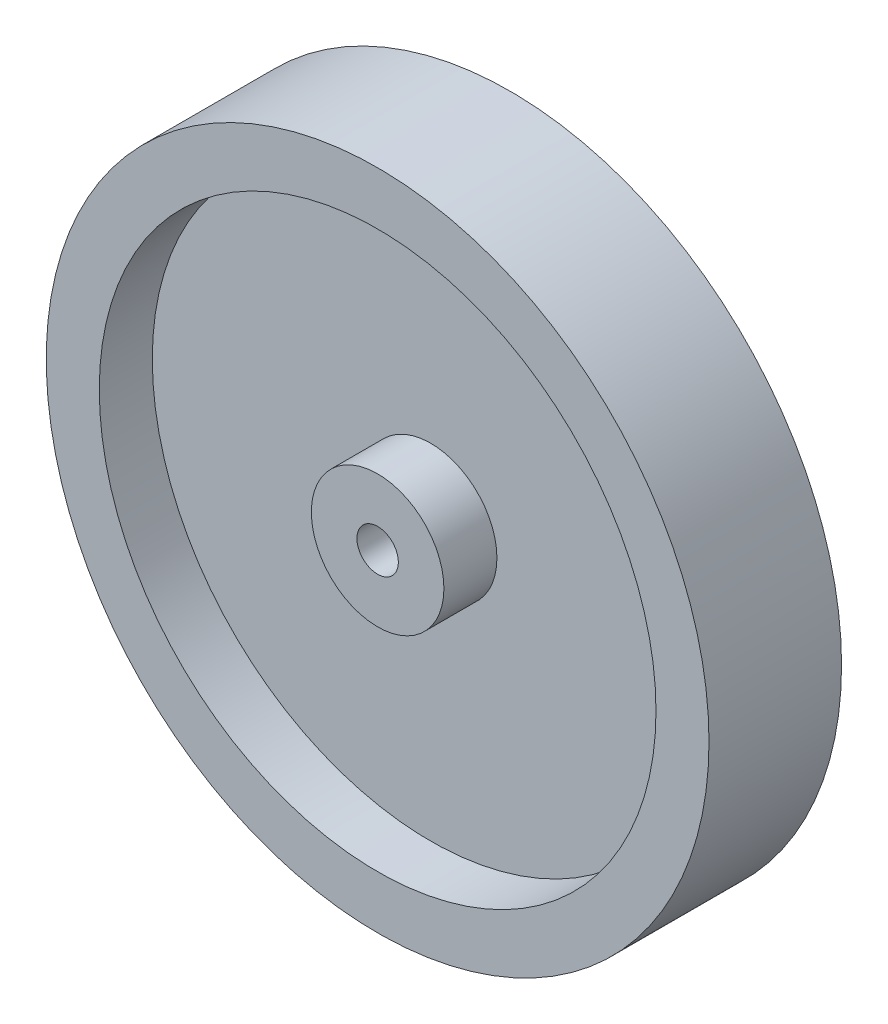
ISO-10303-21;
HEADER;
FILE_DESCRIPTION(('STEP AP214'),'2;1');
FILE_NAME('part.step','',(''),(''),'','','');
FILE_SCHEMA(('AUTOMOTIVE_DESIGN { 1 0 10303 214 1 1 1 1 }'));
ENDSEC;
DATA;
#1=APPLICATION_CONTEXT('core data for automotive mechanical design processes');
#2=APPLICATION_PROTOCOL_DEFINITION('international standard','automotive_design',2000,#1);
#3=PRODUCT_CONTEXT('',#1,'mechanical');
#4=PRODUCT('Part','Part','',(#3));
#5=PRODUCT_RELATED_PRODUCT_CATEGORY('part','',(#4));
#6=PRODUCT_DEFINITION_FORMATION('','',#4);
#7=PRODUCT_DEFINITION_CONTEXT('part definition',#1,'design');
#8=PRODUCT_DEFINITION('design','',#6,#7);
#9=PRODUCT_DEFINITION_SHAPE('','',#8);
#10=(LENGTH_UNIT() NAMED_UNIT(*) SI_UNIT(.MILLI.,.METRE.));
#11=(NAMED_UNIT(*) PLANE_ANGLE_UNIT() SI_UNIT($,.RADIAN.));
#12=(NAMED_UNIT(*) SI_UNIT($,.STERADIAN.) SOLID_ANGLE_UNIT());
#13=UNCERTAINTY_MEASURE_WITH_UNIT(LENGTH_MEASURE(1.E-05),#10,'distance_accuracy_value','');
#14=(GEOMETRIC_REPRESENTATION_CONTEXT(3) GLOBAL_UNCERTAINTY_ASSIGNED_CONTEXT((#13)) GLOBAL_UNIT_ASSIGNED_CONTEXT((#10,
#11,#12)) REPRESENTATION_CONTEXT('',''));
#15=CARTESIAN_POINT('',(0.,0.,0.));
#16=DIRECTION('',(0.,0.,1.));
#17=DIRECTION('',(1.,0.,0.));
#18=AXIS2_PLACEMENT_3D('',#15,#16,#17);
#19=CARTESIAN_POINT('',(0.,0.,-12.7));
#20=DIRECTION('',(0.,0.,1.));
#21=DIRECTION('',(1.,0.,0.));
#22=AXIS2_PLACEMENT_3D('',#19,#20,#21);
#23=PLANE('',#22);
#24=CARTESIAN_POINT('',(0.,0.,-12.7));
#25=DIRECTION('',(0.,0.,1.));
#26=DIRECTION('',(1.,0.,0.));
#27=AXIS2_PLACEMENT_3D('',#24,#25,#26);
#28=CIRCLE('',#27,3.96875);
#29=CARTESIAN_POINT('',(3.96875,0.,-12.7));
#30=VERTEX_POINT('',#29);
#31=EDGE_CURVE('E45',#30,#30,#28,.T.);
#32=ORIENTED_EDGE('',*,*,#31,.T.);
#33=EDGE_LOOP('',(#32));
#34=FACE_BOUND('',#33,.T.);
#35=CARTESIAN_POINT('',(0.,0.,-12.7));
#36=DIRECTION('',(0.,0.,1.));
#37=DIRECTION('',(1.,0.,0.));
#38=AXIS2_PLACEMENT_3D('',#35,#36,#37);
#39=CIRCLE('',#38,12.7);
#40=CARTESIAN_POINT('',(12.7,0.,-12.7));
#41=VERTEX_POINT('',#40);
#42=EDGE_CURVE('E71',#41,#41,#39,.T.);
#43=ORIENTED_EDGE('',*,*,#42,.F.);
#44=EDGE_LOOP('',(#43));
#45=FACE_BOUND('',#44,.T.);
#46=ADVANCED_FACE('F34',(#34,#45),#23,.F.);
#47=CARTESIAN_POINT('',(0.,0.,12.7));
#48=DIRECTION('',(0.,0.,1.));
#49=DIRECTION('',(1.,0.,0.));
#50=AXIS2_PLACEMENT_3D('',#47,#48,#49);
#51=PLANE('',#50);
#52=CARTESIAN_POINT('',(0.,0.,12.7));
#53=DIRECTION('',(0.,0.,1.));
#54=DIRECTION('',(1.,0.,0.));
#55=AXIS2_PLACEMENT_3D('',#52,#53,#54);
#56=CIRCLE('',#55,3.96875);
#57=CARTESIAN_POINT('',(3.96875,0.,12.7));
#58=VERTEX_POINT('',#57);
#59=EDGE_CURVE('E47',#58,#58,#56,.T.);
#60=ORIENTED_EDGE('',*,*,#59,.F.);
#61=EDGE_LOOP('',(#60));
#62=FACE_BOUND('',#61,.T.);
#63=CARTESIAN_POINT('',(0.,0.,12.7));
#64=DIRECTION('',(0.,0.,1.));
#65=DIRECTION('',(1.,0.,0.));
#66=AXIS2_PLACEMENT_3D('',#63,#64,#65);
#67=CIRCLE('',#66,12.7);
#68=CARTESIAN_POINT('',(12.7,0.,12.7));
#69=VERTEX_POINT('',#68);
#70=EDGE_CURVE('E59',#69,#69,#67,.T.);
#71=ORIENTED_EDGE('',*,*,#70,.T.);
#72=EDGE_LOOP('',(#71));
#73=FACE_BOUND('',#72,.T.);
#74=ADVANCED_FACE('F87',(#62,#73),#51,.T.);
#75=CARTESIAN_POINT('',(0.,0.,-12.7));
#76=DIRECTION('',(0.,0.,1.));
#77=DIRECTION('',(1.,0.,0.));
#78=AXIS2_PLACEMENT_3D('',#75,#76,#77);
#79=CYLINDRICAL_SURFACE('',#78,63.5);
#80=CARTESIAN_POINT('',(0.,0.,-12.7));
#81=DIRECTION('',(0.,0.,1.));
#82=DIRECTION('',(1.,0.,0.));
#83=AXIS2_PLACEMENT_3D('',#80,#81,#82);
#84=CIRCLE('',#83,63.5);
#85=CARTESIAN_POINT('',(63.5,0.,-12.7));
#86=VERTEX_POINT('',#85);
#87=EDGE_CURVE('E10',#86,#86,#84,.T.);
#88=ORIENTED_EDGE('',*,*,#87,.T.);
#89=EDGE_LOOP('',(#88));
#90=FACE_BOUND('',#89,.T.);
#91=CARTESIAN_POINT('',(0.,0.,12.7));
#92=DIRECTION('',(0.,0.,1.));
#93=DIRECTION('',(1.,0.,0.));
#94=AXIS2_PLACEMENT_3D('',#91,#92,#93);
#95=CIRCLE('',#94,63.5);
#96=CARTESIAN_POINT('',(63.5,0.,12.7));
#97=VERTEX_POINT('',#96);
#98=EDGE_CURVE('E38',#97,#97,#95,.T.);
#99=ORIENTED_EDGE('',*,*,#98,.F.);
#100=EDGE_LOOP('',(#99));
#101=FACE_BOUND('',#100,.T.);
#102=ADVANCED_FACE('F36',(#90,#101),#79,.T.);
#103=CARTESIAN_POINT('',(0.,0.,-12.7));
#104=DIRECTION('',(0.,0.,1.));
#105=DIRECTION('',(1.,0.,0.));
#106=AXIS2_PLACEMENT_3D('',#103,#104,#105);
#107=CIRCLE('',#106,53.34);
#108=CARTESIAN_POINT('',(53.34,0.,-12.7));
#109=VERTEX_POINT('',#108);
#110=EDGE_CURVE('E65',#109,#109,#107,.T.);
#111=ORIENTED_EDGE('',*,*,#110,.T.);
#112=EDGE_LOOP('',(#111));
#113=FACE_BOUND('',#112,.T.);
#114=ORIENTED_EDGE('',*,*,#87,.F.);
#115=EDGE_LOOP('',(#114));
#116=FACE_BOUND('',#115,.T.);
#117=ADVANCED_FACE('F90',(#113,#116),#23,.F.);
#118=CARTESIAN_POINT('',(0.,0.,12.7));
#119=DIRECTION('',(0.,0.,1.));
#120=DIRECTION('',(1.,0.,0.));
#121=AXIS2_PLACEMENT_3D('',#118,#119,#120);
#122=CIRCLE('',#121,53.34);
#123=CARTESIAN_POINT('',(53.34,0.,12.7));
#124=VERTEX_POINT('',#123);
#125=EDGE_CURVE('E53',#124,#124,#122,.T.);
#126=ORIENTED_EDGE('',*,*,#125,.F.);
#127=EDGE_LOOP('',(#126));
#128=FACE_BOUND('',#127,.T.);
#129=ORIENTED_EDGE('',*,*,#98,.T.);
#130=EDGE_LOOP('',(#129));
#131=FACE_BOUND('',#130,.T.);
#132=ADVANCED_FACE('F95',(#128,#131),#51,.T.);
#133=CARTESIAN_POINT('',(0.,0.,-12.7));
#134=DIRECTION('',(0.,0.,1.));
#135=DIRECTION('',(1.,0.,0.));
#136=AXIS2_PLACEMENT_3D('',#133,#134,#135);
#137=CYLINDRICAL_SURFACE('',#136,3.96875);
#138=ORIENTED_EDGE('',*,*,#31,.F.);
#139=EDGE_LOOP('',(#138));
#140=FACE_BOUND('',#139,.T.);
#141=ORIENTED_EDGE('',*,*,#59,.T.);
#142=EDGE_LOOP('',(#141));
#143=FACE_BOUND('',#142,.T.);
#144=ADVANCED_FACE('F103',(#140,#143),#137,.F.);
#145=CARTESIAN_POINT('',(0.,0.,2.54));
#146=DIRECTION('',(0.,0.,1.));
#147=DIRECTION('',(1.,0.,0.));
#148=AXIS2_PLACEMENT_3D('',#145,#146,#147);
#149=CYLINDRICAL_SURFACE('',#148,53.34);
#150=CARTESIAN_POINT('',(0.,0.,2.54));
#151=DIRECTION('',(0.,0.,1.));
#152=DIRECTION('',(1.,0.,0.));
#153=AXIS2_PLACEMENT_3D('',#150,#151,#152);
#154=CIRCLE('',#153,53.34);
#155=CARTESIAN_POINT('',(53.34,0.,2.54));
#156=VERTEX_POINT('',#155);
#157=EDGE_CURVE('E50',#156,#156,#154,.T.);
#158=ORIENTED_EDGE('',*,*,#157,.F.);
#159=EDGE_LOOP('',(#158));
#160=FACE_BOUND('',#159,.T.);
#161=ORIENTED_EDGE('',*,*,#125,.T.);
#162=EDGE_LOOP('',(#161));
#163=FACE_BOUND('',#162,.T.);
#164=ADVANCED_FACE('F124',(#160,#163),#149,.F.);
#165=CARTESIAN_POINT('',(0.,0.,2.54));
#166=DIRECTION('',(0.,0.,1.));
#167=DIRECTION('',(1.,0.,0.));
#168=AXIS2_PLACEMENT_3D('',#165,#166,#167);
#169=PLANE('',#168);
#170=CARTESIAN_POINT('',(0.,0.,2.54));
#171=DIRECTION('',(0.,0.,1.));
#172=DIRECTION('',(1.,0.,0.));
#173=AXIS2_PLACEMENT_3D('',#170,#171,#172);
#174=CIRCLE('',#173,12.7);
#175=CARTESIAN_POINT('',(12.7,0.,2.54));
#176=VERTEX_POINT('',#175);
#177=EDGE_CURVE('E56',#176,#176,#174,.T.);
#178=ORIENTED_EDGE('',*,*,#177,.F.);
#179=EDGE_LOOP('',(#178));
#180=FACE_BOUND('',#179,.T.);
#181=ORIENTED_EDGE('',*,*,#157,.T.);
#182=EDGE_LOOP('',(#181));
#183=FACE_BOUND('',#182,.T.);
#184=ADVANCED_FACE('F120',(#180,#183),#169,.T.);
#185=CARTESIAN_POINT('',(0.,0.,2.54));
#186=DIRECTION('',(0.,0.,1.));
#187=DIRECTION('',(1.,0.,0.));
#188=AXIS2_PLACEMENT_3D('',#185,#186,#187);
#189=CYLINDRICAL_SURFACE('',#188,12.7);
#190=ORIENTED_EDGE('',*,*,#177,.T.);
#191=EDGE_LOOP('',(#190));
#192=FACE_BOUND('',#191,.T.);
#193=ORIENTED_EDGE('',*,*,#70,.F.);
#194=EDGE_LOOP('',(#193));
#195=FACE_BOUND('',#194,.T.);
#196=ADVANCED_FACE('F114',(#192,#195),#189,.T.);
#197=CARTESIAN_POINT('',(0.,0.,-2.54));
#198=DIRECTION('',(0.,0.,-1.));
#199=DIRECTION('',(1.,0.,0.));
#200=AXIS2_PLACEMENT_3D('',#197,#198,#199);
#201=PLANE('',#200);
#202=CARTESIAN_POINT('',(0.,0.,-2.54));
#203=DIRECTION('',(0.,0.,1.));
#204=DIRECTION('',(1.,0.,0.));
#205=AXIS2_PLACEMENT_3D('',#202,#203,#204);
#206=CIRCLE('',#205,53.34);
#207=CARTESIAN_POINT('',(53.34,0.,-2.54));
#208=VERTEX_POINT('',#207);
#209=EDGE_CURVE('E62',#208,#208,#206,.T.);
#210=ORIENTED_EDGE('',*,*,#209,.F.);
#211=EDGE_LOOP('',(#210));
#212=FACE_BOUND('',#211,.T.);
#213=CARTESIAN_POINT('',(0.,0.,-2.54));
#214=DIRECTION('',(0.,0.,1.));
#215=DIRECTION('',(1.,0.,0.));
#216=AXIS2_PLACEMENT_3D('',#213,#214,#215);
#217=CIRCLE('',#216,12.7);
#218=CARTESIAN_POINT('',(12.7,0.,-2.54));
#219=VERTEX_POINT('',#218);
#220=EDGE_CURVE('E68',#219,#219,#217,.T.);
#221=ORIENTED_EDGE('',*,*,#220,.T.);
#222=EDGE_LOOP('',(#221));
#223=FACE_BOUND('',#222,.T.);
#224=ADVANCED_FACE('F77',(#212,#223),#201,.T.);
#225=CARTESIAN_POINT('',(0.,0.,-2.54));
#226=DIRECTION('',(0.,0.,-1.));
#227=DIRECTION('',(-1.,0.,0.));
#228=AXIS2_PLACEMENT_3D('',#225,#226,#227);
#229=CYLINDRICAL_SURFACE('',#228,53.34);
#230=ORIENTED_EDGE('',*,*,#209,.T.);
#231=EDGE_LOOP('',(#230));
#232=FACE_BOUND('',#231,.T.);
#233=ORIENTED_EDGE('',*,*,#110,.F.);
#234=EDGE_LOOP('',(#233));
#235=FACE_BOUND('',#234,.T.);
#236=ADVANCED_FACE('F82',(#232,#235),#229,.F.);
#237=CARTESIAN_POINT('',(0.,0.,-2.54));
#238=DIRECTION('',(0.,0.,-1.));
#239=DIRECTION('',(-1.,0.,0.));
#240=AXIS2_PLACEMENT_3D('',#237,#238,#239);
#241=CYLINDRICAL_SURFACE('',#240,12.7);
#242=ORIENTED_EDGE('',*,*,#220,.F.);
#243=EDGE_LOOP('',(#242));
#244=FACE_BOUND('',#243,.T.);
#245=ORIENTED_EDGE('',*,*,#42,.T.);
#246=EDGE_LOOP('',(#245));
#247=FACE_BOUND('',#246,.T.);
#248=ADVANCED_FACE('F79',(#244,#247),#241,.T.);
#249=CLOSED_SHELL('',(#46,#74,#102,#117,#132,#144,#164,#184,#196,#224,#236,#248));
#250=MANIFOLD_SOLID_BREP('B2',#249);
#251=ADVANCED_BREP_SHAPE_REPRESENTATION('',(#18,#250),#14);
#252=SHAPE_DEFINITION_REPRESENTATION(#9,#251);
ENDSEC;
END-ISO-10303-21;
